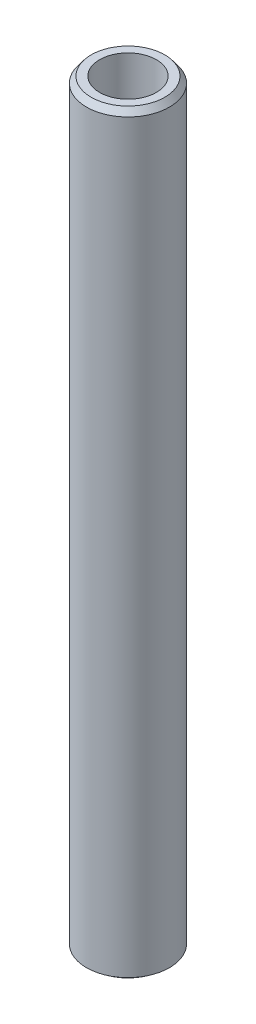
ISO-10303-21;
HEADER;
FILE_DESCRIPTION(('STEP AP214'),'2;1');
FILE_NAME('part.step','',(''),(''),'','','');
FILE_SCHEMA(('AUTOMOTIVE_DESIGN { 1 0 10303 214 1 1 1 1 }'));
ENDSEC;
DATA;
#1=APPLICATION_CONTEXT('core data for automotive mechanical design processes');
#2=APPLICATION_PROTOCOL_DEFINITION('international standard','automotive_design',2000,#1);
#3=PRODUCT_CONTEXT('',#1,'mechanical');
#4=PRODUCT('Part','Part','',(#3));
#5=PRODUCT_RELATED_PRODUCT_CATEGORY('part','',(#4));
#6=PRODUCT_DEFINITION_FORMATION('','',#4);
#7=PRODUCT_DEFINITION_CONTEXT('part definition',#1,'design');
#8=PRODUCT_DEFINITION('design','',#6,#7);
#9=PRODUCT_DEFINITION_SHAPE('','',#8);
#10=(LENGTH_UNIT() NAMED_UNIT(*) SI_UNIT(.MILLI.,.METRE.));
#11=(NAMED_UNIT(*) PLANE_ANGLE_UNIT() SI_UNIT($,.RADIAN.));
#12=(NAMED_UNIT(*) SI_UNIT($,.STERADIAN.) SOLID_ANGLE_UNIT());
#13=UNCERTAINTY_MEASURE_WITH_UNIT(LENGTH_MEASURE(1.E-05),#10,'distance_accuracy_value','');
#14=(GEOMETRIC_REPRESENTATION_CONTEXT(3) GLOBAL_UNCERTAINTY_ASSIGNED_CONTEXT((#13)) GLOBAL_UNIT_ASSIGNED_CONTEXT((#10,
#11,#12)) REPRESENTATION_CONTEXT('',''));
#15=CARTESIAN_POINT('',(0.,0.,0.));
#16=DIRECTION('',(0.,0.,1.));
#17=DIRECTION('',(1.,0.,0.));
#18=AXIS2_PLACEMENT_3D('',#15,#16,#17);
#19=CARTESIAN_POINT('',(0.,273.534332491604,0.));
#20=DIRECTION('',(0.,-1.,0.));
#21=DIRECTION('',(0.,0.,-1.));
#22=AXIS2_PLACEMENT_3D('',#19,#20,#21);
#23=CYLINDRICAL_SURFACE('',#22,15.);
#24=CARTESIAN_POINT('',(0.,271.302327117629,0.));
#25=DIRECTION('',(0.,1.,0.));
#26=DIRECTION('',(0.,0.,1.));
#27=AXIS2_PLACEMENT_3D('',#24,#25,#26);
#28=CIRCLE('',#27,15.);
#29=CARTESIAN_POINT('',(0.,271.302327117629,15.));
#30=VERTEX_POINT('',#29);
#31=EDGE_CURVE('E50',#30,#30,#28,.F.);
#32=ORIENTED_EDGE('',*,*,#31,.T.);
#33=EDGE_LOOP('',(#32));
#34=FACE_BOUND('',#33,.T.);
#35=CARTESIAN_POINT('',(0.,1.68819059243885,0.));
#36=DIRECTION('',(0.,1.,0.));
#37=DIRECTION('',(0.,0.,1.));
#38=AXIS2_PLACEMENT_3D('',#35,#36,#37);
#39=CIRCLE('',#38,15.);
#40=CARTESIAN_POINT('',(0.,1.68819059243885,15.));
#41=VERTEX_POINT('',#40);
#42=EDGE_CURVE('E51',#41,#41,#39,.T.);
#43=ORIENTED_EDGE('',*,*,#42,.T.);
#44=EDGE_LOOP('',(#43));
#45=FACE_BOUND('',#44,.T.);
#46=ADVANCED_FACE('F39',(#34,#45),#23,.T.);
#47=CARTESIAN_POINT('',(0.,273.534332491604,0.));
#48=DIRECTION('',(0.,1.,0.));
#49=DIRECTION('',(0.,0.,1.));
#50=AXIS2_PLACEMENT_3D('',#47,#48,#49);
#51=PLANE('',#50);
#52=CARTESIAN_POINT('',(0.,273.534332491604,0.));
#53=DIRECTION('',(0.,1.,0.));
#54=DIRECTION('',(0.,0.,1.));
#55=AXIS2_PLACEMENT_3D('',#52,#53,#54);
#56=CIRCLE('',#55,13.311809407561);
#57=CARTESIAN_POINT('',(0.,273.534332491604,13.311809407561));
#58=VERTEX_POINT('',#57);
#59=EDGE_CURVE('E54',#58,#58,#56,.T.);
#60=ORIENTED_EDGE('',*,*,#59,.T.);
#61=EDGE_LOOP('',(#60));
#62=FACE_BOUND('',#61,.T.);
#63=CARTESIAN_POINT('',(0.,273.534332491604,0.));
#64=DIRECTION('',(0.,1.,0.));
#65=DIRECTION('',(0.,0.,1.));
#66=AXIS2_PLACEMENT_3D('',#63,#64,#65);
#67=CIRCLE('',#66,10.2729018855625);
#68=CARTESIAN_POINT('',(0.,273.534332491604,10.2729018855625));
#69=VERTEX_POINT('',#68);
#70=EDGE_CURVE('E58',#69,#69,#67,.T.);
#71=ORIENTED_EDGE('',*,*,#70,.F.);
#72=EDGE_LOOP('',(#71));
#73=FACE_BOUND('',#72,.T.);
#74=ADVANCED_FACE('F69',(#62,#73),#51,.T.);
#75=CARTESIAN_POINT('',(0.,0.,0.));
#76=DIRECTION('',(0.,1.,0.));
#77=DIRECTION('',(0.,0.,1.));
#78=AXIS2_PLACEMENT_3D('',#75,#76,#77);
#79=PLANE('',#78);
#80=CARTESIAN_POINT('',(0.,0.,0.));
#81=DIRECTION('',(0.,1.,0.));
#82=DIRECTION('',(0.,0.,1.));
#83=AXIS2_PLACEMENT_3D('',#80,#81,#82);
#84=CIRCLE('',#83,12.7679946260258);
#85=CARTESIAN_POINT('',(0.,0.,12.7679946260258));
#86=VERTEX_POINT('',#85);
#87=EDGE_CURVE('E10',#86,#86,#84,.F.);
#88=ORIENTED_EDGE('',*,*,#87,.T.);
#89=EDGE_LOOP('',(#88));
#90=FACE_BOUND('',#89,.T.);
#91=CARTESIAN_POINT('',(0.,0.,0.));
#92=DIRECTION('',(0.,1.,0.));
#93=DIRECTION('',(0.,0.,1.));
#94=AXIS2_PLACEMENT_3D('',#91,#92,#93);
#95=CIRCLE('',#94,10.2729018855625);
#96=CARTESIAN_POINT('',(0.,0.,10.2729018855625));
#97=VERTEX_POINT('',#96);
#98=EDGE_CURVE('E63',#97,#97,#95,.T.);
#99=ORIENTED_EDGE('',*,*,#98,.T.);
#100=EDGE_LOOP('',(#99));
#101=FACE_BOUND('',#100,.T.);
#102=ADVANCED_FACE('F75',(#90,#101),#79,.F.);
#103=CARTESIAN_POINT('',(0.,273.534332491604,0.));
#104=DIRECTION('',(0.,-1.,0.));
#105=DIRECTION('',(0.,0.,-1.));
#106=AXIS2_PLACEMENT_3D('',#103,#104,#105);
#107=CYLINDRICAL_SURFACE('',#106,10.2729018855625);
#108=ORIENTED_EDGE('',*,*,#70,.T.);
#109=EDGE_LOOP('',(#108));
#110=FACE_BOUND('',#109,.T.);
#111=ORIENTED_EDGE('',*,*,#98,.F.);
#112=EDGE_LOOP('',(#111));
#113=FACE_BOUND('',#112,.T.);
#114=ADVANCED_FACE('F70',(#110,#113),#107,.F.);
#115=CARTESIAN_POINT('',(0.,273.534332491604,0.));
#116=DIRECTION('',(0.,-1.,0.));
#117=DIRECTION('',(0.,0.,-1.));
#118=AXIS2_PLACEMENT_3D('',#115,#116,#117);
#119=CONICAL_SURFACE('',#118,13.311809407561,0.6475565355203);
#120=ORIENTED_EDGE('',*,*,#31,.F.);
#121=EDGE_LOOP('',(#120));
#122=FACE_BOUND('',#121,.T.);
#123=ORIENTED_EDGE('',*,*,#59,.F.);
#124=EDGE_LOOP('',(#123));
#125=FACE_BOUND('',#124,.T.);
#126=ADVANCED_FACE('F81',(#122,#125),#119,.T.);
#127=CARTESIAN_POINT('',(0.,1.68819059243885,0.));
#128=DIRECTION('',(0.,1.,0.));
#129=DIRECTION('',(0.,0.,1.));
#130=AXIS2_PLACEMENT_3D('',#127,#128,#129);
#131=CONICAL_SURFACE('',#130,15.,0.923239791274599);
#132=ORIENTED_EDGE('',*,*,#87,.F.);
#133=EDGE_LOOP('',(#132));
#134=FACE_BOUND('',#133,.T.);
#135=ORIENTED_EDGE('',*,*,#42,.F.);
#136=EDGE_LOOP('',(#135));
#137=FACE_BOUND('',#136,.T.);
#138=ADVANCED_FACE('F45',(#134,#137),#131,.T.);
#139=CLOSED_SHELL('',(#46,#74,#102,#114,#126,#138));
#140=MANIFOLD_SOLID_BREP('B2',#139);
#141=ADVANCED_BREP_SHAPE_REPRESENTATION('',(#18,#140),#14);
#142=SHAPE_DEFINITION_REPRESENTATION(#9,#141);
ENDSEC;
END-ISO-10303-21;
